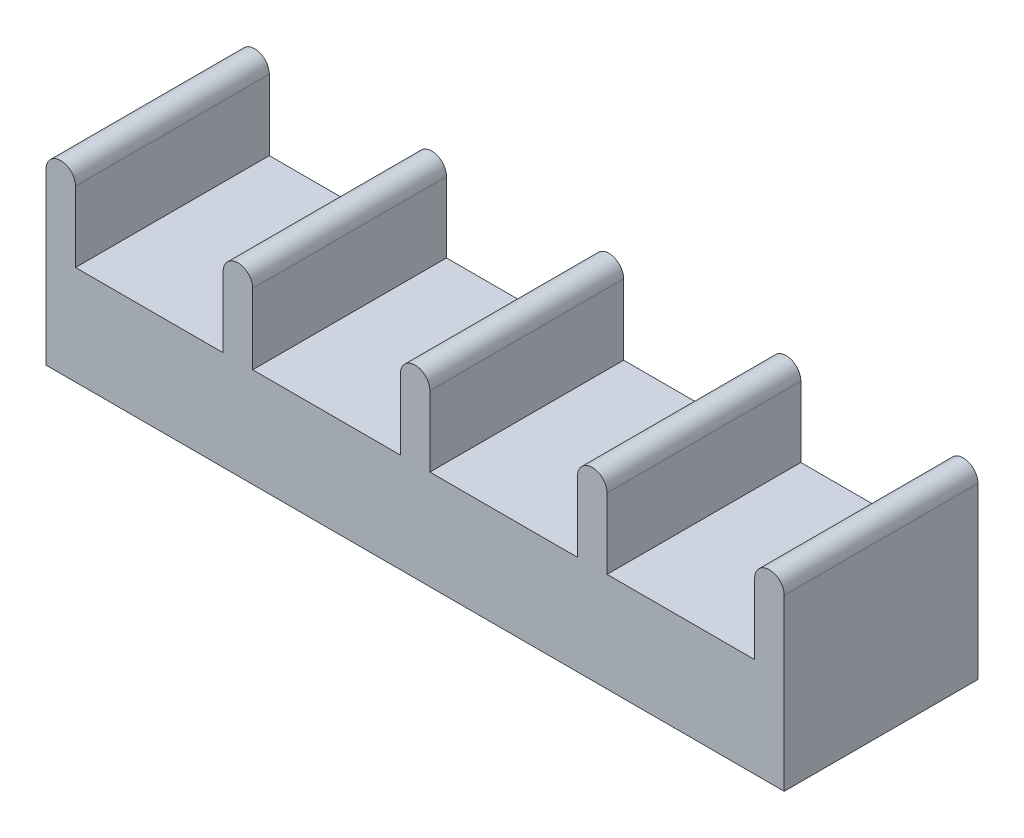
ISO-10303-21;
HEADER;
FILE_DESCRIPTION(('STEP AP214'),'2;1');
FILE_NAME('part.step','',(''),(''),'','','');
FILE_SCHEMA(('AUTOMOTIVE_DESIGN { 1 0 10303 214 1 1 1 1 }'));
ENDSEC;
DATA;
#1=APPLICATION_CONTEXT('core data for automotive mechanical design processes');
#2=APPLICATION_PROTOCOL_DEFINITION('international standard','automotive_design',2000,#1);
#3=PRODUCT_CONTEXT('',#1,'mechanical');
#4=PRODUCT('Part','Part','',(#3));
#5=PRODUCT_RELATED_PRODUCT_CATEGORY('part','',(#4));
#6=PRODUCT_DEFINITION_FORMATION('','',#4);
#7=PRODUCT_DEFINITION_CONTEXT('part definition',#1,'design');
#8=PRODUCT_DEFINITION('design','',#6,#7);
#9=PRODUCT_DEFINITION_SHAPE('','',#8);
#10=(LENGTH_UNIT() NAMED_UNIT(*) SI_UNIT(.MILLI.,.METRE.));
#11=(NAMED_UNIT(*) PLANE_ANGLE_UNIT() SI_UNIT($,.RADIAN.));
#12=(NAMED_UNIT(*) SI_UNIT($,.STERADIAN.) SOLID_ANGLE_UNIT());
#13=UNCERTAINTY_MEASURE_WITH_UNIT(LENGTH_MEASURE(1.E-05),#10,'distance_accuracy_value','');
#14=(GEOMETRIC_REPRESENTATION_CONTEXT(3) GLOBAL_UNCERTAINTY_ASSIGNED_CONTEXT((#13)) GLOBAL_UNIT_ASSIGNED_CONTEXT((#10,
#11,#12)) REPRESENTATION_CONTEXT('',''));
#15=CARTESIAN_POINT('',(0.,0.,0.));
#16=DIRECTION('',(0.,0.,1.));
#17=DIRECTION('',(1.,0.,0.));
#18=AXIS2_PLACEMENT_3D('',#15,#16,#17);
#19=CARTESIAN_POINT('',(11.5382996382869,11.04,19.6871972318339));
#20=DIRECTION('',(0.,0.,1.));
#21=DIRECTION('',(1.,0.,0.));
#22=AXIS2_PLACEMENT_3D('',#19,#20,#21);
#23=CYLINDRICAL_SURFACE('',#22,0.960000000000005);
#24=DIRECTION('',(0.,0.,1.));
#25=VECTOR('',#24,1.);
#26=CARTESIAN_POINT('',(10.5782996382869,11.04,4.68719723183392));
#27=LINE('',#26,#25);
#28=CARTESIAN_POINT('',(10.5782996382869,11.04,19.6871972318339));
#29=VERTEX_POINT('',#28);
#30=CARTESIAN_POINT('',(10.5782996382869,11.04,7.08719723183392));
#31=VERTEX_POINT('',#30);
#32=EDGE_CURVE('E389',#29,#31,#27,.F.);
#33=ORIENTED_EDGE('',*,*,#32,.F.);
#34=CARTESIAN_POINT('',(11.5382996382869,11.04,19.6871972318339));
#35=DIRECTION('',(0.,0.,-1.));
#36=DIRECTION('',(-1.,0.,0.));
#37=AXIS2_PLACEMENT_3D('',#34,#35,#36);
#38=CIRCLE('',#37,0.960000000000005);
#39=CARTESIAN_POINT('',(12.4982996382869,11.04,19.6871972318339));
#40=VERTEX_POINT('',#39);
#41=EDGE_CURVE('E54',#40,#29,#38,.F.);
#42=ORIENTED_EDGE('',*,*,#41,.F.);
#43=DIRECTION('',(0.,0.,-1.));
#44=VECTOR('',#43,1.);
#45=CARTESIAN_POINT('',(12.4982996382869,11.04,19.6871972318339));
#46=LINE('',#45,#44);
#47=CARTESIAN_POINT('',(12.4982996382869,11.04,7.08719723183392));
#48=VERTEX_POINT('',#47);
#49=EDGE_CURVE('E393',#48,#40,#46,.F.);
#50=ORIENTED_EDGE('',*,*,#49,.F.);
#51=CARTESIAN_POINT('',(11.5382996382869,11.04,7.08719723183392));
#52=DIRECTION('',(0.,0.,-1.));
#53=DIRECTION('',(-1.,0.,0.));
#54=AXIS2_PLACEMENT_3D('',#51,#52,#53);
#55=CIRCLE('',#54,0.960000000000005);
#56=EDGE_CURVE('E11',#31,#48,#55,.T.);
#57=ORIENTED_EDGE('',*,*,#56,.F.);
#58=EDGE_LOOP('',(#33,#42,#50,#57));
#59=FACE_BOUND('',#58,.T.);
#60=ADVANCED_FACE('F45',(#59),#23,.T.);
#61=CARTESIAN_POINT('',(0.018299638286851,11.04,19.6871972318339));
#62=DIRECTION('',(0.,0.,1.));
#63=DIRECTION('',(1.,0.,0.));
#64=AXIS2_PLACEMENT_3D('',#61,#62,#63);
#65=CYLINDRICAL_SURFACE('',#64,0.96);
#66=DIRECTION('',(0.,0.,1.));
#67=VECTOR('',#66,1.);
#68=CARTESIAN_POINT('',(-0.941700361713149,11.04,4.68719723183392));
#69=LINE('',#68,#67);
#70=CARTESIAN_POINT('',(-0.941700361713149,11.04,19.6871972318339));
#71=VERTEX_POINT('',#70);
#72=CARTESIAN_POINT('',(-0.941700361713149,11.04,7.08719723183392));
#73=VERTEX_POINT('',#72);
#74=EDGE_CURVE('E375',#71,#73,#69,.F.);
#75=ORIENTED_EDGE('',*,*,#74,.F.);
#76=CARTESIAN_POINT('',(0.018299638286851,11.04,19.6871972318339));
#77=DIRECTION('',(0.,0.,-1.));
#78=DIRECTION('',(-1.,0.,0.));
#79=AXIS2_PLACEMENT_3D('',#76,#77,#78);
#80=CIRCLE('',#79,0.96);
#81=CARTESIAN_POINT('',(0.978299638286851,11.04,19.6871972318339));
#82=VERTEX_POINT('',#81);
#83=EDGE_CURVE('E383',#82,#71,#80,.F.);
#84=ORIENTED_EDGE('',*,*,#83,.F.);
#85=DIRECTION('',(0.,0.,1.));
#86=VECTOR('',#85,1.);
#87=CARTESIAN_POINT('',(0.978299638286851,11.04,4.68719723183392));
#88=LINE('',#87,#86);
#89=CARTESIAN_POINT('',(0.978299638286849,11.04,7.08719723183392));
#90=VERTEX_POINT('',#89);
#91=EDGE_CURVE('E379',#90,#82,#88,.T.);
#92=ORIENTED_EDGE('',*,*,#91,.F.);
#93=CARTESIAN_POINT('',(0.018299638286851,11.04,7.08719723183392));
#94=DIRECTION('',(0.,0.,-1.));
#95=DIRECTION('',(-1.,0.,0.));
#96=AXIS2_PLACEMENT_3D('',#93,#94,#95);
#97=CIRCLE('',#96,0.96);
#98=EDGE_CURVE('E386',#73,#90,#97,.T.);
#99=ORIENTED_EDGE('',*,*,#98,.F.);
#100=EDGE_LOOP('',(#75,#84,#92,#99));
#101=FACE_BOUND('',#100,.T.);
#102=ADVANCED_FACE('F413',(#101),#65,.T.);
#103=CARTESIAN_POINT('',(-11.5017003617131,11.04,19.6871972318339));
#104=DIRECTION('',(0.,0.,1.));
#105=DIRECTION('',(1.,0.,0.));
#106=AXIS2_PLACEMENT_3D('',#103,#104,#105);
#107=CYLINDRICAL_SURFACE('',#106,0.96);
#108=DIRECTION('',(0.,0.,1.));
#109=VECTOR('',#108,1.);
#110=CARTESIAN_POINT('',(-12.4617003617132,11.04,4.68719723183392));
#111=LINE('',#110,#109);
#112=CARTESIAN_POINT('',(-12.4617003617132,11.04,19.6871972318339));
#113=VERTEX_POINT('',#112);
#114=CARTESIAN_POINT('',(-12.4617003617132,11.04,7.08719723183392));
#115=VERTEX_POINT('',#114);
#116=EDGE_CURVE('E361',#113,#115,#111,.F.);
#117=ORIENTED_EDGE('',*,*,#116,.F.);
#118=CARTESIAN_POINT('',(-11.5017003617131,11.04,19.6871972318339));
#119=DIRECTION('',(0.,0.,-1.));
#120=DIRECTION('',(-1.,0.,0.));
#121=AXIS2_PLACEMENT_3D('',#118,#119,#120);
#122=CIRCLE('',#121,0.96);
#123=CARTESIAN_POINT('',(-10.5417003617132,11.04,19.6871972318339));
#124=VERTEX_POINT('',#123);
#125=EDGE_CURVE('E369',#124,#113,#122,.F.);
#126=ORIENTED_EDGE('',*,*,#125,.F.);
#127=DIRECTION('',(0.,0.,1.));
#128=VECTOR('',#127,1.);
#129=CARTESIAN_POINT('',(-10.5417003617132,11.04,4.68719723183392));
#130=LINE('',#129,#128);
#131=CARTESIAN_POINT('',(-10.5417003617132,11.04,7.08719723183392));
#132=VERTEX_POINT('',#131);
#133=EDGE_CURVE('E365',#132,#124,#130,.T.);
#134=ORIENTED_EDGE('',*,*,#133,.F.);
#135=CARTESIAN_POINT('',(-11.5017003617131,11.04,7.08719723183392));
#136=DIRECTION('',(0.,0.,-1.));
#137=DIRECTION('',(-1.,0.,0.));
#138=AXIS2_PLACEMENT_3D('',#135,#136,#137);
#139=CIRCLE('',#138,0.96);
#140=EDGE_CURVE('E372',#115,#132,#139,.T.);
#141=ORIENTED_EDGE('',*,*,#140,.F.);
#142=EDGE_LOOP('',(#117,#126,#134,#141));
#143=FACE_BOUND('',#142,.T.);
#144=ADVANCED_FACE('F433',(#143),#107,.T.);
#145=CARTESIAN_POINT('',(-23.0217003617131,11.04,19.6871972318339));
#146=DIRECTION('',(0.,0.,1.));
#147=DIRECTION('',(1.,0.,0.));
#148=AXIS2_PLACEMENT_3D('',#145,#146,#147);
#149=CYLINDRICAL_SURFACE('',#148,0.959999999999999);
#150=DIRECTION('',(0.,0.,1.));
#151=VECTOR('',#150,1.);
#152=CARTESIAN_POINT('',(-23.9817003617131,11.04,4.68719723183392));
#153=LINE('',#152,#151);
#154=CARTESIAN_POINT('',(-23.9817003617131,11.04,19.6871972318339));
#155=VERTEX_POINT('',#154);
#156=CARTESIAN_POINT('',(-23.9817003617131,11.04,7.08719723183392));
#157=VERTEX_POINT('',#156);
#158=EDGE_CURVE('E347',#155,#157,#153,.F.);
#159=ORIENTED_EDGE('',*,*,#158,.F.);
#160=CARTESIAN_POINT('',(-23.0217003617131,11.04,19.6871972318339));
#161=DIRECTION('',(0.,0.,-1.));
#162=DIRECTION('',(-1.,0.,0.));
#163=AXIS2_PLACEMENT_3D('',#160,#161,#162);
#164=CIRCLE('',#163,0.959999999999999);
#165=CARTESIAN_POINT('',(-22.0617003617132,11.04,19.6871972318339));
#166=VERTEX_POINT('',#165);
#167=EDGE_CURVE('E355',#166,#155,#164,.F.);
#168=ORIENTED_EDGE('',*,*,#167,.F.);
#169=DIRECTION('',(0.,0.,1.));
#170=VECTOR('',#169,1.);
#171=CARTESIAN_POINT('',(-22.0617003617132,11.04,4.68719723183392));
#172=LINE('',#171,#170);
#173=CARTESIAN_POINT('',(-22.0617003617132,11.04,7.08719723183392));
#174=VERTEX_POINT('',#173);
#175=EDGE_CURVE('E351',#174,#166,#172,.T.);
#176=ORIENTED_EDGE('',*,*,#175,.F.);
#177=CARTESIAN_POINT('',(-23.0217003617131,11.04,7.08719723183392));
#178=DIRECTION('',(0.,0.,-1.));
#179=DIRECTION('',(-1.,0.,0.));
#180=AXIS2_PLACEMENT_3D('',#177,#178,#179);
#181=CIRCLE('',#180,0.959999999999999);
#182=EDGE_CURVE('E358',#157,#174,#181,.T.);
#183=ORIENTED_EDGE('',*,*,#182,.F.);
#184=EDGE_LOOP('',(#159,#168,#176,#183));
#185=FACE_BOUND('',#184,.T.);
#186=ADVANCED_FACE('F450',(#185),#149,.T.);
#187=CARTESIAN_POINT('',(-34.5417003617131,11.04,19.6871972318339));
#188=DIRECTION('',(0.,0.,1.));
#189=DIRECTION('',(1.,0.,0.));
#190=AXIS2_PLACEMENT_3D('',#187,#188,#189);
#191=CYLINDRICAL_SURFACE('',#190,0.959999999999998);
#192=DIRECTION('',(0.,0.,1.));
#193=VECTOR('',#192,1.);
#194=CARTESIAN_POINT('',(-35.5017003617131,11.04,7.08719723183392));
#195=LINE('',#194,#193);
#196=CARTESIAN_POINT('',(-35.5017003617131,11.04,19.6871972318339));
#197=VERTEX_POINT('',#196);
#198=CARTESIAN_POINT('',(-35.5017003617131,11.04,7.08719723183392));
#199=VERTEX_POINT('',#198);
#200=EDGE_CURVE('E327',#197,#199,#195,.F.);
#201=ORIENTED_EDGE('',*,*,#200,.F.);
#202=CARTESIAN_POINT('',(-34.5417003617131,11.04,19.6871972318339));
#203=DIRECTION('',(0.,0.,-1.));
#204=DIRECTION('',(-1.,0.,0.));
#205=AXIS2_PLACEMENT_3D('',#202,#203,#204);
#206=CIRCLE('',#205,0.959999999999998);
#207=CARTESIAN_POINT('',(-33.5817003617131,11.04,19.6871972318339));
#208=VERTEX_POINT('',#207);
#209=EDGE_CURVE('E341',#208,#197,#206,.F.);
#210=ORIENTED_EDGE('',*,*,#209,.F.);
#211=DIRECTION('',(0.,0.,1.));
#212=VECTOR('',#211,1.);
#213=CARTESIAN_POINT('',(-33.5817003617131,11.04,4.68719723183392));
#214=LINE('',#213,#212);
#215=CARTESIAN_POINT('',(-33.5817003617131,11.04,7.08719723183392));
#216=VERTEX_POINT('',#215);
#217=EDGE_CURVE('E188',#216,#208,#214,.T.);
#218=ORIENTED_EDGE('',*,*,#217,.F.);
#219=CARTESIAN_POINT('',(-34.5417003617131,11.04,7.08719723183392));
#220=DIRECTION('',(0.,0.,-1.));
#221=DIRECTION('',(-1.,0.,0.));
#222=AXIS2_PLACEMENT_3D('',#219,#220,#221);
#223=CIRCLE('',#222,0.959999999999998);
#224=EDGE_CURVE('E344',#199,#216,#223,.T.);
#225=ORIENTED_EDGE('',*,*,#224,.F.);
#226=EDGE_LOOP('',(#201,#210,#218,#225));
#227=FACE_BOUND('',#226,.T.);
#228=ADVANCED_FACE('F457',(#227),#191,.T.);
#229=CARTESIAN_POINT('',(-35.5017003617131,12.,7.08719723183392));
#230=DIRECTION('',(0.,0.,-1.));
#231=DIRECTION('',(-1.,0.,0.));
#232=AXIS2_PLACEMENT_3D('',#229,#230,#231);
#233=PLANE('',#232);
#234=DIRECTION('',(0.,-1.,0.));
#235=VECTOR('',#234,1.);
#236=CARTESIAN_POINT('',(10.5782996382869,12.,7.08719723183392));
#237=LINE('',#236,#235);
#238=CARTESIAN_POINT('',(10.5782996382869,6.45712199535333,7.08719723183392));
#239=VERTEX_POINT('',#238);
#240=EDGE_CURVE('E293',#31,#239,#237,.T.);
#241=ORIENTED_EDGE('',*,*,#240,.F.);
#242=ORIENTED_EDGE('',*,*,#56,.T.);
#243=DIRECTION('',(0.,-1.,0.));
#244=VECTOR('',#243,1.);
#245=CARTESIAN_POINT('',(12.4982996382869,12.,7.08719723183392));
#246=LINE('',#245,#244);
#247=CARTESIAN_POINT('',(12.4982996382869,0.,7.08719723183392));
#248=VERTEX_POINT('',#247);
#249=EDGE_CURVE('E323',#48,#248,#246,.T.);
#250=ORIENTED_EDGE('',*,*,#249,.T.);
#251=DIRECTION('',(1.,0.,0.));
#252=VECTOR('',#251,1.);
#253=CARTESIAN_POINT('',(-35.5017003617131,0.,7.08719723183392));
#254=LINE('',#253,#252);
#255=CARTESIAN_POINT('',(-35.5017003617131,0.,7.08719723183392));
#256=VERTEX_POINT('',#255);
#257=EDGE_CURVE('E307',#256,#248,#254,.T.);
#258=ORIENTED_EDGE('',*,*,#257,.F.);
#259=DIRECTION('',(0.,-1.,0.));
#260=VECTOR('',#259,1.);
#261=CARTESIAN_POINT('',(-35.5017003617131,12.,7.08719723183392));
#262=LINE('',#261,#260);
#263=EDGE_CURVE('E324',#199,#256,#262,.T.);
#264=ORIENTED_EDGE('',*,*,#263,.F.);
#265=ORIENTED_EDGE('',*,*,#224,.T.);
#266=DIRECTION('',(0.,1.,0.));
#267=VECTOR('',#266,1.);
#268=CARTESIAN_POINT('',(-33.5817003617131,12.,7.08719723183392));
#269=LINE('',#268,#267);
#270=CARTESIAN_POINT('',(-33.5817003617131,6.45712199535333,7.08719723183392));
#271=VERTEX_POINT('',#270);
#272=EDGE_CURVE('E249',#271,#216,#269,.T.);
#273=ORIENTED_EDGE('',*,*,#272,.F.);
#274=DIRECTION('',(-1.,0.,0.));
#275=VECTOR('',#274,1.);
#276=CARTESIAN_POINT('',(-35.5017003617131,6.45712199535333,7.08719723183392));
#277=LINE('',#276,#275);
#278=CARTESIAN_POINT('',(-23.9817003617131,6.45712199535333,7.08719723183392));
#279=VERTEX_POINT('',#278);
#280=EDGE_CURVE('E200',#279,#271,#277,.T.);
#281=ORIENTED_EDGE('',*,*,#280,.F.);
#282=DIRECTION('',(0.,-1.,0.));
#283=VECTOR('',#282,1.);
#284=CARTESIAN_POINT('',(-23.9817003617131,12.,7.08719723183392));
#285=LINE('',#284,#283);
#286=EDGE_CURVE('E272',#157,#279,#285,.T.);
#287=ORIENTED_EDGE('',*,*,#286,.F.);
#288=ORIENTED_EDGE('',*,*,#182,.T.);
#289=DIRECTION('',(0.,1.,0.));
#290=VECTOR('',#289,1.);
#291=CARTESIAN_POINT('',(-22.0617003617132,12.,7.08719723183392));
#292=LINE('',#291,#290);
#293=CARTESIAN_POINT('',(-22.0617003617132,6.45712199535333,7.08719723183392));
#294=VERTEX_POINT('',#293);
#295=EDGE_CURVE('E275',#294,#174,#292,.T.);
#296=ORIENTED_EDGE('',*,*,#295,.F.);
#297=DIRECTION('',(-1.,0.,0.));
#298=VECTOR('',#297,1.);
#299=CARTESIAN_POINT('',(-35.5017003617131,6.45712199535333,7.08719723183392));
#300=LINE('',#299,#298);
#301=CARTESIAN_POINT('',(-12.4617003617132,6.45712199535333,7.08719723183392));
#302=VERTEX_POINT('',#301);
#303=EDGE_CURVE('E298',#302,#294,#300,.T.);
#304=ORIENTED_EDGE('',*,*,#303,.F.);
#305=DIRECTION('',(0.,-1.,0.));
#306=VECTOR('',#305,1.);
#307=CARTESIAN_POINT('',(-12.4617003617132,12.,7.08719723183392));
#308=LINE('',#307,#306);
#309=EDGE_CURVE('E279',#115,#302,#308,.T.);
#310=ORIENTED_EDGE('',*,*,#309,.F.);
#311=ORIENTED_EDGE('',*,*,#140,.T.);
#312=DIRECTION('',(0.,1.,0.));
#313=VECTOR('',#312,1.);
#314=CARTESIAN_POINT('',(-10.5417003617132,12.,7.08719723183392));
#315=LINE('',#314,#313);
#316=CARTESIAN_POINT('',(-10.5417003617131,6.45712199535333,7.08719723183392));
#317=VERTEX_POINT('',#316);
#318=EDGE_CURVE('E282',#317,#132,#315,.T.);
#319=ORIENTED_EDGE('',*,*,#318,.F.);
#320=DIRECTION('',(-1.,0.,0.));
#321=VECTOR('',#320,1.);
#322=CARTESIAN_POINT('',(-35.5017003617131,6.45712199535333,7.08719723183392));
#323=LINE('',#322,#321);
#324=CARTESIAN_POINT('',(-0.941700361713149,6.45712199535333,7.08719723183392));
#325=VERTEX_POINT('',#324);
#326=EDGE_CURVE('E301',#325,#317,#323,.T.);
#327=ORIENTED_EDGE('',*,*,#326,.F.);
#328=DIRECTION('',(0.,-1.,0.));
#329=VECTOR('',#328,1.);
#330=CARTESIAN_POINT('',(-0.941700361713149,12.,7.08719723183392));
#331=LINE('',#330,#329);
#332=EDGE_CURVE('E286',#73,#325,#331,.T.);
#333=ORIENTED_EDGE('',*,*,#332,.F.);
#334=ORIENTED_EDGE('',*,*,#98,.T.);
#335=DIRECTION('',(0.,1.,0.));
#336=VECTOR('',#335,1.);
#337=CARTESIAN_POINT('',(0.978299638286849,12.,7.08719723183392));
#338=LINE('',#337,#336);
#339=CARTESIAN_POINT('',(0.978299638286852,6.45712199535333,7.08719723183392));
#340=VERTEX_POINT('',#339);
#341=EDGE_CURVE('E289',#340,#90,#338,.T.);
#342=ORIENTED_EDGE('',*,*,#341,.F.);
#343=DIRECTION('',(-1.,0.,0.));
#344=VECTOR('',#343,1.);
#345=CARTESIAN_POINT('',(-35.5017003617131,6.45712199535333,7.08719723183392));
#346=LINE('',#345,#344);
#347=EDGE_CURVE('E304',#239,#340,#346,.T.);
#348=ORIENTED_EDGE('',*,*,#347,.F.);
#349=EDGE_LOOP('',(#241,#242,#250,#258,#264,#265,#273,#281,#287,#288,#296,#304,#310,#311,#319,
#327,#333,#334,#342,#348));
#350=FACE_BOUND('',#349,.T.);
#351=ADVANCED_FACE('F427',(#350),#233,.T.);
#352=CARTESIAN_POINT('',(-35.5017003617131,12.,7.08719723183392));
#353=DIRECTION('',(1.,0.,0.));
#354=DIRECTION('',(0.,0.,-1.));
#355=AXIS2_PLACEMENT_3D('',#352,#353,#354);
#356=PLANE('',#355);
#357=DIRECTION('',(0.,-1.,0.));
#358=VECTOR('',#357,1.);
#359=CARTESIAN_POINT('',(-35.5017003617131,12.,19.6871972318339));
#360=LINE('',#359,#358);
#361=CARTESIAN_POINT('',(-35.5017003617131,0.,19.6871972318339));
#362=VERTEX_POINT('',#361);
#363=EDGE_CURVE('E328',#197,#362,#360,.T.);
#364=ORIENTED_EDGE('',*,*,#363,.F.);
#365=ORIENTED_EDGE('',*,*,#200,.T.);
#366=ORIENTED_EDGE('',*,*,#263,.T.);
#367=DIRECTION('',(0.,0.,1.));
#368=VECTOR('',#367,1.);
#369=CARTESIAN_POINT('',(-35.5017003617131,0.,7.08719723183392));
#370=LINE('',#369,#368);
#371=EDGE_CURVE('E319',#256,#362,#370,.T.);
#372=ORIENTED_EDGE('',*,*,#371,.T.);
#373=EDGE_LOOP('',(#364,#365,#366,#372));
#374=FACE_BOUND('',#373,.T.);
#375=ADVANCED_FACE('F462',(#374),#356,.F.);
#376=CARTESIAN_POINT('',(-35.5017003617131,12.,19.6871972318339));
#377=DIRECTION('',(0.,0.,-1.));
#378=DIRECTION('',(-1.,0.,0.));
#379=AXIS2_PLACEMENT_3D('',#376,#377,#378);
#380=PLANE('',#379);
#381=DIRECTION('',(0.,-1.,0.));
#382=VECTOR('',#381,1.);
#383=CARTESIAN_POINT('',(12.4982996382869,12.,19.6871972318339));
#384=LINE('',#383,#382);
#385=CARTESIAN_POINT('',(12.4982996382869,0.,19.6871972318339));
#386=VERTEX_POINT('',#385);
#387=EDGE_CURVE('E331',#40,#386,#384,.T.);
#388=ORIENTED_EDGE('',*,*,#387,.F.);
#389=ORIENTED_EDGE('',*,*,#41,.T.);
#390=DIRECTION('',(0.,1.,0.));
#391=VECTOR('',#390,1.);
#392=CARTESIAN_POINT('',(10.5782996382869,6.45712199535333,19.6871972318339));
#393=LINE('',#392,#391);
#394=CARTESIAN_POINT('',(10.5782996382869,6.45712199535333,19.6871972318339));
#395=VERTEX_POINT('',#394);
#396=EDGE_CURVE('E203',#395,#29,#393,.T.);
#397=ORIENTED_EDGE('',*,*,#396,.F.);
#398=DIRECTION('',(1.,0.,0.));
#399=VECTOR('',#398,1.);
#400=CARTESIAN_POINT('',(0.978299638286852,6.45712199535333,19.6871972318339));
#401=LINE('',#400,#399);
#402=CARTESIAN_POINT('',(0.978299638286852,6.45712199535333,19.6871972318339));
#403=VERTEX_POINT('',#402);
#404=EDGE_CURVE('E239',#403,#395,#401,.T.);
#405=ORIENTED_EDGE('',*,*,#404,.F.);
#406=DIRECTION('',(0.,-1.,0.));
#407=VECTOR('',#406,1.);
#408=CARTESIAN_POINT('',(0.978299638286851,15.4047295588778,19.6871972318339));
#409=LINE('',#408,#407);
#410=EDGE_CURVE('E236',#82,#403,#409,.T.);
#411=ORIENTED_EDGE('',*,*,#410,.F.);
#412=ORIENTED_EDGE('',*,*,#83,.T.);
#413=DIRECTION('',(0.,1.,0.));
#414=VECTOR('',#413,1.);
#415=CARTESIAN_POINT('',(-0.941700361713149,6.45712199535333,19.6871972318339));
#416=LINE('',#415,#414);
#417=CARTESIAN_POINT('',(-0.941700361713149,6.45712199535333,19.6871972318339));
#418=VERTEX_POINT('',#417);
#419=EDGE_CURVE('E232',#418,#71,#416,.T.);
#420=ORIENTED_EDGE('',*,*,#419,.F.);
#421=DIRECTION('',(1.,0.,0.));
#422=VECTOR('',#421,1.);
#423=CARTESIAN_POINT('',(-10.5417003617131,6.45712199535333,19.6871972318339));
#424=LINE('',#423,#422);
#425=CARTESIAN_POINT('',(-10.5417003617131,6.45712199535333,19.6871972318339));
#426=VERTEX_POINT('',#425);
#427=EDGE_CURVE('E228',#426,#418,#424,.T.);
#428=ORIENTED_EDGE('',*,*,#427,.F.);
#429=DIRECTION('',(0.,-1.,0.));
#430=VECTOR('',#429,1.);
#431=CARTESIAN_POINT('',(-10.5417003617132,15.4047295588778,19.6871972318339));
#432=LINE('',#431,#430);
#433=EDGE_CURVE('E225',#124,#426,#432,.T.);
#434=ORIENTED_EDGE('',*,*,#433,.F.);
#435=ORIENTED_EDGE('',*,*,#125,.T.);
#436=DIRECTION('',(0.,1.,0.));
#437=VECTOR('',#436,1.);
#438=CARTESIAN_POINT('',(-12.4617003617132,6.45712199535333,19.6871972318339));
#439=LINE('',#438,#437);
#440=CARTESIAN_POINT('',(-12.4617003617132,6.45712199535333,19.6871972318339));
#441=VERTEX_POINT('',#440);
#442=EDGE_CURVE('E221',#441,#113,#439,.T.);
#443=ORIENTED_EDGE('',*,*,#442,.F.);
#444=DIRECTION('',(1.,0.,0.));
#445=VECTOR('',#444,1.);
#446=CARTESIAN_POINT('',(-22.0617003617132,6.45712199535333,19.6871972318339));
#447=LINE('',#446,#445);
#448=CARTESIAN_POINT('',(-22.0617003617132,6.45712199535333,19.6871972318339));
#449=VERTEX_POINT('',#448);
#450=EDGE_CURVE('E217',#449,#441,#447,.T.);
#451=ORIENTED_EDGE('',*,*,#450,.F.);
#452=DIRECTION('',(0.,-1.,0.));
#453=VECTOR('',#452,1.);
#454=CARTESIAN_POINT('',(-22.0617003617132,15.0468252563369,19.6871972318339));
#455=LINE('',#454,#453);
#456=EDGE_CURVE('E212',#166,#449,#455,.T.);
#457=ORIENTED_EDGE('',*,*,#456,.F.);
#458=ORIENTED_EDGE('',*,*,#167,.T.);
#459=DIRECTION('',(0.,1.,0.));
#460=VECTOR('',#459,1.);
#461=CARTESIAN_POINT('',(-23.9817003617131,6.45712199535333,19.6871972318339));
#462=LINE('',#461,#460);
#463=CARTESIAN_POINT('',(-23.9817003617131,6.45712199535333,19.6871972318339));
#464=VERTEX_POINT('',#463);
#465=EDGE_CURVE('E208',#464,#155,#462,.T.);
#466=ORIENTED_EDGE('',*,*,#465,.F.);
#467=DIRECTION('',(1.,0.,0.));
#468=VECTOR('',#467,1.);
#469=CARTESIAN_POINT('',(-33.5817003617131,6.45712199535333,19.6871972318339));
#470=LINE('',#469,#468);
#471=CARTESIAN_POINT('',(-33.5817003617131,6.45712199535333,19.6871972318339));
#472=VERTEX_POINT('',#471);
#473=EDGE_CURVE('E192',#472,#464,#470,.T.);
#474=ORIENTED_EDGE('',*,*,#473,.F.);
#475=DIRECTION('',(0.,-1.,0.));
#476=VECTOR('',#475,1.);
#477=CARTESIAN_POINT('',(-33.5817003617131,12.,19.6871972318339));
#478=LINE('',#477,#476);
#479=EDGE_CURVE('E181',#208,#472,#478,.T.);
#480=ORIENTED_EDGE('',*,*,#479,.F.);
#481=ORIENTED_EDGE('',*,*,#209,.T.);
#482=ORIENTED_EDGE('',*,*,#363,.T.);
#483=DIRECTION('',(1.,0.,0.));
#484=VECTOR('',#483,1.);
#485=CARTESIAN_POINT('',(-35.5017003617131,0.,19.6871972318339));
#486=LINE('',#485,#484);
#487=EDGE_CURVE('E315',#362,#386,#486,.T.);
#488=ORIENTED_EDGE('',*,*,#487,.T.);
#489=EDGE_LOOP('',(#388,#389,#397,#405,#411,#412,#420,#428,#434,#435,#443,#451,#457,#458,#466,
#474,#480,#481,#482,#488));
#490=FACE_BOUND('',#489,.T.);
#491=ADVANCED_FACE('F206',(#490),#380,.F.);
#492=CARTESIAN_POINT('',(12.4982996382869,12.,7.08719723183392));
#493=DIRECTION('',(1.,0.,0.));
#494=DIRECTION('',(0.,0.,-1.));
#495=AXIS2_PLACEMENT_3D('',#492,#493,#494);
#496=PLANE('',#495);
#497=ORIENTED_EDGE('',*,*,#249,.F.);
#498=ORIENTED_EDGE('',*,*,#49,.T.);
#499=ORIENTED_EDGE('',*,*,#387,.T.);
#500=DIRECTION('',(0.,0.,1.));
#501=VECTOR('',#500,1.);
#502=CARTESIAN_POINT('',(12.4982996382869,0.,7.08719723183392));
#503=LINE('',#502,#501);
#504=EDGE_CURVE('E311',#248,#386,#503,.T.);
#505=ORIENTED_EDGE('',*,*,#504,.F.);
#506=EDGE_LOOP('',(#497,#498,#499,#505));
#507=FACE_BOUND('',#506,.T.);
#508=ADVANCED_FACE('F468',(#507),#496,.T.);
#509=CARTESIAN_POINT('',(0.,0.,0.));
#510=DIRECTION('',(0.,-1.,0.));
#511=DIRECTION('',(0.,0.,-1.));
#512=AXIS2_PLACEMENT_3D('',#509,#510,#511);
#513=PLANE('',#512);
#514=ORIENTED_EDGE('',*,*,#257,.T.);
#515=ORIENTED_EDGE('',*,*,#504,.T.);
#516=ORIENTED_EDGE('',*,*,#487,.F.);
#517=ORIENTED_EDGE('',*,*,#371,.F.);
#518=EDGE_LOOP('',(#514,#515,#516,#517));
#519=FACE_BOUND('',#518,.T.);
#520=ADVANCED_FACE('F464',(#519),#513,.T.);
#521=CARTESIAN_POINT('',(-33.5817003617131,12.,4.68719723183392));
#522=DIRECTION('',(-1.,0.,0.));
#523=DIRECTION('',(0.,0.,1.));
#524=AXIS2_PLACEMENT_3D('',#521,#522,#523);
#525=PLANE('',#524);
#526=ORIENTED_EDGE('',*,*,#272,.T.);
#527=ORIENTED_EDGE('',*,*,#217,.T.);
#528=ORIENTED_EDGE('',*,*,#479,.T.);
#529=DIRECTION('',(0.,0.,1.));
#530=VECTOR('',#529,1.);
#531=CARTESIAN_POINT('',(-33.5817003617131,6.45712199535333,4.68719723183392));
#532=LINE('',#531,#530);
#533=EDGE_CURVE('E185',#271,#472,#532,.T.);
#534=ORIENTED_EDGE('',*,*,#533,.F.);
#535=EDGE_LOOP('',(#526,#527,#528,#534));
#536=FACE_BOUND('',#535,.T.);
#537=ADVANCED_FACE('F184',(#536),#525,.F.);
#538=CARTESIAN_POINT('',(-23.9817003617131,6.45712199535333,4.68719723183392));
#539=DIRECTION('',(1.,0.,0.));
#540=DIRECTION('',(0.,0.,-1.));
#541=AXIS2_PLACEMENT_3D('',#538,#539,#540);
#542=PLANE('',#541);
#543=ORIENTED_EDGE('',*,*,#465,.T.);
#544=ORIENTED_EDGE('',*,*,#158,.T.);
#545=ORIENTED_EDGE('',*,*,#286,.T.);
#546=DIRECTION('',(0.,0.,1.));
#547=VECTOR('',#546,1.);
#548=CARTESIAN_POINT('',(-23.9817003617131,6.45712199535333,4.68719723183392));
#549=LINE('',#548,#547);
#550=EDGE_CURVE('E202',#279,#464,#549,.T.);
#551=ORIENTED_EDGE('',*,*,#550,.T.);
#552=EDGE_LOOP('',(#543,#544,#545,#551));
#553=FACE_BOUND('',#552,.T.);
#554=ADVANCED_FACE('F452',(#553),#542,.F.);
#555=CARTESIAN_POINT('',(-33.5817003617131,6.45712199535333,4.68719723183392));
#556=DIRECTION('',(0.,-1.,0.));
#557=DIRECTION('',(0.,0.,-1.));
#558=AXIS2_PLACEMENT_3D('',#555,#556,#557);
#559=PLANE('',#558);
#560=ORIENTED_EDGE('',*,*,#280,.T.);
#561=ORIENTED_EDGE('',*,*,#533,.T.);
#562=ORIENTED_EDGE('',*,*,#473,.T.);
#563=ORIENTED_EDGE('',*,*,#550,.F.);
#564=EDGE_LOOP('',(#560,#561,#562,#563));
#565=FACE_BOUND('',#564,.T.);
#566=ADVANCED_FACE('F196',(#565),#559,.F.);
#567=CARTESIAN_POINT('',(-22.0617003617132,15.0468252563369,4.68719723183392));
#568=DIRECTION('',(-1.,0.,0.));
#569=DIRECTION('',(0.,0.,1.));
#570=AXIS2_PLACEMENT_3D('',#567,#568,#569);
#571=PLANE('',#570);
#572=ORIENTED_EDGE('',*,*,#295,.T.);
#573=ORIENTED_EDGE('',*,*,#175,.T.);
#574=ORIENTED_EDGE('',*,*,#456,.T.);
#575=DIRECTION('',(0.,0.,1.));
#576=VECTOR('',#575,1.);
#577=CARTESIAN_POINT('',(-22.0617003617132,6.45712199535333,4.68719723183392));
#578=LINE('',#577,#576);
#579=EDGE_CURVE('E264',#294,#449,#578,.T.);
#580=ORIENTED_EDGE('',*,*,#579,.F.);
#581=EDGE_LOOP('',(#572,#573,#574,#580));
#582=FACE_BOUND('',#581,.T.);
#583=ADVANCED_FACE('F445',(#582),#571,.F.);
#584=CARTESIAN_POINT('',(-12.4617003617132,6.45712199535333,4.68719723183392));
#585=DIRECTION('',(1.,0.,0.));
#586=DIRECTION('',(0.,0.,-1.));
#587=AXIS2_PLACEMENT_3D('',#584,#585,#586);
#588=PLANE('',#587);
#589=ORIENTED_EDGE('',*,*,#442,.T.);
#590=ORIENTED_EDGE('',*,*,#116,.T.);
#591=ORIENTED_EDGE('',*,*,#309,.T.);
#592=DIRECTION('',(0.,0.,1.));
#593=VECTOR('',#592,1.);
#594=CARTESIAN_POINT('',(-12.4617003617132,6.45712199535333,4.68719723183392));
#595=LINE('',#594,#593);
#596=EDGE_CURVE('E261',#302,#441,#595,.T.);
#597=ORIENTED_EDGE('',*,*,#596,.T.);
#598=EDGE_LOOP('',(#589,#590,#591,#597));
#599=FACE_BOUND('',#598,.T.);
#600=ADVANCED_FACE('F438',(#599),#588,.F.);
#601=CARTESIAN_POINT('',(-22.0617003617132,6.45712199535333,4.68719723183392));
#602=DIRECTION('',(0.,-1.,0.));
#603=DIRECTION('',(0.,0.,-1.));
#604=AXIS2_PLACEMENT_3D('',#601,#602,#603);
#605=PLANE('',#604);
#606=ORIENTED_EDGE('',*,*,#303,.T.);
#607=ORIENTED_EDGE('',*,*,#579,.T.);
#608=ORIENTED_EDGE('',*,*,#450,.T.);
#609=ORIENTED_EDGE('',*,*,#596,.F.);
#610=EDGE_LOOP('',(#606,#607,#608,#609));
#611=FACE_BOUND('',#610,.T.);
#612=ADVANCED_FACE('F441',(#611),#605,.F.);
#613=CARTESIAN_POINT('',(-10.5417003617132,15.4047295588778,4.68719723183392));
#614=DIRECTION('',(-1.,0.,0.));
#615=DIRECTION('',(0.,-1.,0.));
#616=AXIS2_PLACEMENT_3D('',#613,#614,#615);
#617=PLANE('',#616);
#618=ORIENTED_EDGE('',*,*,#318,.T.);
#619=ORIENTED_EDGE('',*,*,#133,.T.);
#620=ORIENTED_EDGE('',*,*,#433,.T.);
#621=DIRECTION('',(0.,0.,1.));
#622=VECTOR('',#621,1.);
#623=CARTESIAN_POINT('',(-10.5417003617131,6.45712199535333,4.68719723183392));
#624=LINE('',#623,#622);
#625=EDGE_CURVE('E257',#317,#426,#624,.T.);
#626=ORIENTED_EDGE('',*,*,#625,.F.);
#627=EDGE_LOOP('',(#618,#619,#620,#626));
#628=FACE_BOUND('',#627,.T.);
#629=ADVANCED_FACE('F426',(#628),#617,.F.);
#630=CARTESIAN_POINT('',(-0.941700361713149,6.45712199535333,4.68719723183392));
#631=DIRECTION('',(1.,0.,0.));
#632=DIRECTION('',(0.,0.,-1.));
#633=AXIS2_PLACEMENT_3D('',#630,#631,#632);
#634=PLANE('',#633);
#635=ORIENTED_EDGE('',*,*,#419,.T.);
#636=ORIENTED_EDGE('',*,*,#74,.T.);
#637=ORIENTED_EDGE('',*,*,#332,.T.);
#638=DIRECTION('',(0.,0.,1.));
#639=VECTOR('',#638,1.);
#640=CARTESIAN_POINT('',(-0.941700361713149,6.45712199535333,4.68719723183392));
#641=LINE('',#640,#639);
#642=EDGE_CURVE('E254',#325,#418,#641,.T.);
#643=ORIENTED_EDGE('',*,*,#642,.T.);
#644=EDGE_LOOP('',(#635,#636,#637,#643));
#645=FACE_BOUND('',#644,.T.);
#646=ADVANCED_FACE('F416',(#645),#634,.F.);
#647=CARTESIAN_POINT('',(-10.5417003617131,6.45712199535333,4.68719723183392));
#648=DIRECTION('',(0.,-1.,0.));
#649=DIRECTION('',(0.,0.,-1.));
#650=AXIS2_PLACEMENT_3D('',#647,#648,#649);
#651=PLANE('',#650);
#652=ORIENTED_EDGE('',*,*,#326,.T.);
#653=ORIENTED_EDGE('',*,*,#625,.T.);
#654=ORIENTED_EDGE('',*,*,#427,.T.);
#655=ORIENTED_EDGE('',*,*,#642,.F.);
#656=EDGE_LOOP('',(#652,#653,#654,#655));
#657=FACE_BOUND('',#656,.T.);
#658=ADVANCED_FACE('F421',(#657),#651,.F.);
#659=CARTESIAN_POINT('',(10.5782996382869,6.45712199535333,4.68719723183392));
#660=DIRECTION('',(1.,0.,0.));
#661=DIRECTION('',(0.,0.,-1.));
#662=AXIS2_PLACEMENT_3D('',#659,#660,#661);
#663=PLANE('',#662);
#664=ORIENTED_EDGE('',*,*,#396,.T.);
#665=ORIENTED_EDGE('',*,*,#32,.T.);
#666=ORIENTED_EDGE('',*,*,#240,.T.);
#667=DIRECTION('',(0.,0.,1.));
#668=VECTOR('',#667,1.);
#669=CARTESIAN_POINT('',(10.5782996382869,6.45712199535333,4.68719723183392));
#670=LINE('',#669,#668);
#671=EDGE_CURVE('E246',#239,#395,#670,.T.);
#672=ORIENTED_EDGE('',*,*,#671,.T.);
#673=EDGE_LOOP('',(#664,#665,#666,#672));
#674=FACE_BOUND('',#673,.T.);
#675=ADVANCED_FACE('F399',(#674),#663,.F.);
#676=CARTESIAN_POINT('',(0.978299638286852,6.45712199535333,4.68719723183392));
#677=DIRECTION('',(0.,-1.,0.));
#678=DIRECTION('',(0.,0.,-1.));
#679=AXIS2_PLACEMENT_3D('',#676,#677,#678);
#680=PLANE('',#679);
#681=ORIENTED_EDGE('',*,*,#347,.T.);
#682=DIRECTION('',(0.,0.,1.));
#683=VECTOR('',#682,1.);
#684=CARTESIAN_POINT('',(0.978299638286852,6.45712199535333,4.68719723183392));
#685=LINE('',#684,#683);
#686=EDGE_CURVE('E250',#340,#403,#685,.T.);
#687=ORIENTED_EDGE('',*,*,#686,.T.);
#688=ORIENTED_EDGE('',*,*,#404,.T.);
#689=ORIENTED_EDGE('',*,*,#671,.F.);
#690=EDGE_LOOP('',(#681,#687,#688,#689));
#691=FACE_BOUND('',#690,.T.);
#692=ADVANCED_FACE('F403',(#691),#680,.F.);
#693=CARTESIAN_POINT('',(0.978299638286851,15.4047295588778,4.68719723183392));
#694=DIRECTION('',(-1.,0.,0.));
#695=DIRECTION('',(0.,-1.,0.));
#696=AXIS2_PLACEMENT_3D('',#693,#694,#695);
#697=PLANE('',#696);
#698=ORIENTED_EDGE('',*,*,#341,.T.);
#699=ORIENTED_EDGE('',*,*,#91,.T.);
#700=ORIENTED_EDGE('',*,*,#410,.T.);
#701=ORIENTED_EDGE('',*,*,#686,.F.);
#702=EDGE_LOOP('',(#698,#699,#700,#701));
#703=FACE_BOUND('',#702,.T.);
#704=ADVANCED_FACE('F409',(#703),#697,.F.);
#705=CLOSED_SHELL('',(#60,#102,#144,#186,#228,#351,#375,#491,#508,#520,#537,#554,#566,#583,#600,
#612,#629,#646,#658,#675,#692,#704));
#706=MANIFOLD_SOLID_BREP('B2',#705);
#707=ADVANCED_BREP_SHAPE_REPRESENTATION('',(#18,#706),#14);
#708=SHAPE_DEFINITION_REPRESENTATION(#9,#707);
ENDSEC;
END-ISO-10303-21;
